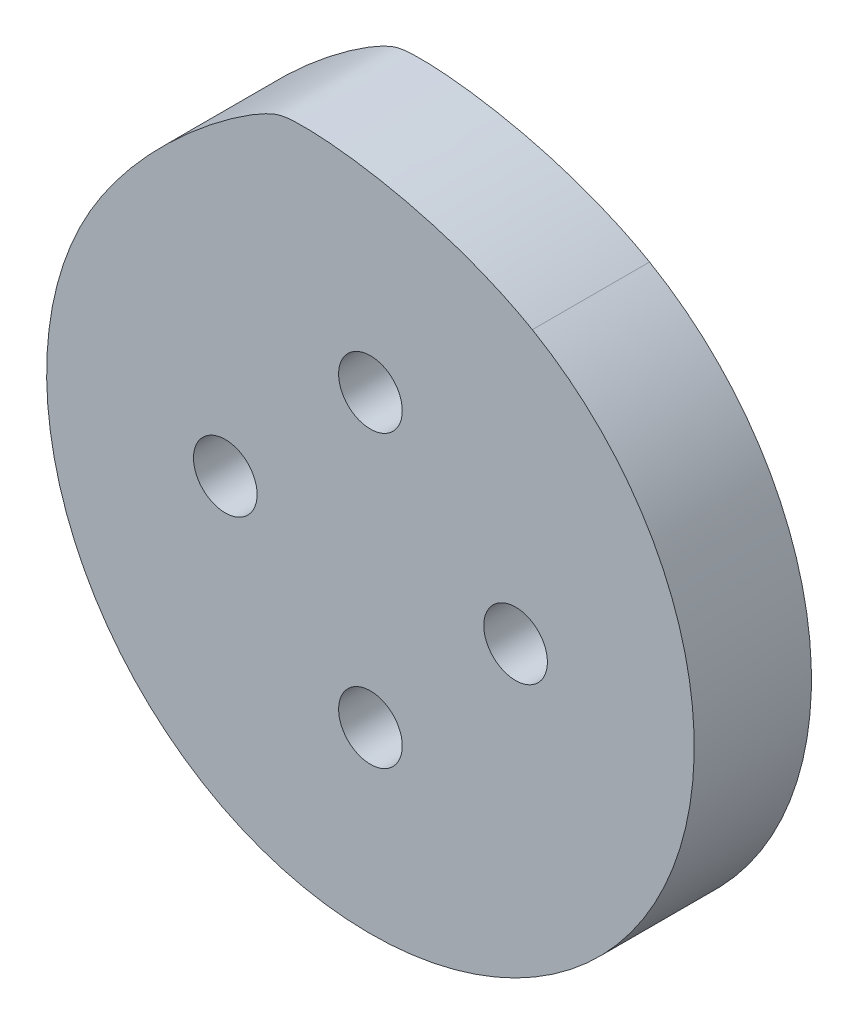
ISO-10303-21;
HEADER;
FILE_DESCRIPTION(('STEP AP214'),'2;1');
FILE_NAME('part.step','',(''),(''),'','','');
FILE_SCHEMA(('AUTOMOTIVE_DESIGN { 1 0 10303 214 1 1 1 1 }'));
ENDSEC;
DATA;
#1=APPLICATION_CONTEXT('core data for automotive mechanical design processes');
#2=APPLICATION_PROTOCOL_DEFINITION('international standard','automotive_design',2000,#1);
#3=PRODUCT_CONTEXT('',#1,'mechanical');
#4=PRODUCT('Part','Part','',(#3));
#5=PRODUCT_RELATED_PRODUCT_CATEGORY('part','',(#4));
#6=PRODUCT_DEFINITION_FORMATION('','',#4);
#7=PRODUCT_DEFINITION_CONTEXT('part definition',#1,'design');
#8=PRODUCT_DEFINITION('design','',#6,#7);
#9=PRODUCT_DEFINITION_SHAPE('','',#8);
#10=(LENGTH_UNIT() NAMED_UNIT(*) SI_UNIT(.MILLI.,.METRE.));
#11=(NAMED_UNIT(*) PLANE_ANGLE_UNIT() SI_UNIT($,.RADIAN.));
#12=(NAMED_UNIT(*) SI_UNIT($,.STERADIAN.) SOLID_ANGLE_UNIT());
#13=UNCERTAINTY_MEASURE_WITH_UNIT(LENGTH_MEASURE(1.E-05),#10,'distance_accuracy_value','');
#14=(GEOMETRIC_REPRESENTATION_CONTEXT(3) GLOBAL_UNCERTAINTY_ASSIGNED_CONTEXT((#13)) GLOBAL_UNIT_ASSIGNED_CONTEXT((#10,
#11,#12)) REPRESENTATION_CONTEXT('',''));
#15=CARTESIAN_POINT('',(0.,0.,0.));
#16=DIRECTION('',(0.,0.,1.));
#17=DIRECTION('',(1.,0.,0.));
#18=AXIS2_PLACEMENT_3D('',#15,#16,#17);
#19=CARTESIAN_POINT('',(13.,0.,10.5));
#20=DIRECTION('',(0.,0.,-1.));
#21=DIRECTION('',(-1.,0.,0.));
#22=AXIS2_PLACEMENT_3D('',#19,#20,#21);
#23=CYLINDRICAL_SURFACE('',#22,1.6);
#24=CARTESIAN_POINT('',(13.,0.,-0.5));
#25=DIRECTION('',(0.,0.,-1.));
#26=DIRECTION('',(-1.,0.,0.));
#27=AXIS2_PLACEMENT_3D('',#24,#25,#26);
#28=CIRCLE('',#27,1.6);
#29=CARTESIAN_POINT('',(11.4,0.,-0.5));
#30=VERTEX_POINT('',#29);
#31=EDGE_CURVE('E131',#30,#30,#28,.T.);
#32=ORIENTED_EDGE('',*,*,#31,.T.);
#33=EDGE_LOOP('',(#32));
#34=FACE_BOUND('',#33,.T.);
#35=CARTESIAN_POINT('',(13.,0.,2.));
#36=DIRECTION('',(0.,0.,1.));
#37=DIRECTION('',(1.,0.,0.));
#38=AXIS2_PLACEMENT_3D('',#35,#36,#37);
#39=CIRCLE('',#38,1.6);
#40=CARTESIAN_POINT('',(14.6,0.,2.));
#41=VERTEX_POINT('',#40);
#42=EDGE_CURVE('E193',#41,#41,#39,.T.);
#43=ORIENTED_EDGE('',*,*,#42,.T.);
#44=EDGE_LOOP('',(#43));
#45=FACE_BOUND('',#44,.T.);
#46=ADVANCED_FACE('F49',(#34,#45),#23,.F.);
#47=CARTESIAN_POINT('',(0.,13.,10.5));
#48=DIRECTION('',(0.,0.,-1.));
#49=DIRECTION('',(-1.,0.,0.));
#50=AXIS2_PLACEMENT_3D('',#47,#48,#49);
#51=CYLINDRICAL_SURFACE('',#50,1.6);
#52=CARTESIAN_POINT('',(0.,13.,-0.5));
#53=DIRECTION('',(0.,0.,-1.));
#54=DIRECTION('',(-1.,0.,0.));
#55=AXIS2_PLACEMENT_3D('',#52,#53,#54);
#56=CIRCLE('',#55,1.6);
#57=CARTESIAN_POINT('',(-1.59999999999996,13.,-0.5));
#58=VERTEX_POINT('',#57);
#59=EDGE_CURVE('E125',#58,#58,#56,.T.);
#60=ORIENTED_EDGE('',*,*,#59,.T.);
#61=EDGE_LOOP('',(#60));
#62=FACE_BOUND('',#61,.T.);
#63=CARTESIAN_POINT('',(0.,13.,2.));
#64=DIRECTION('',(0.,0.,1.));
#65=DIRECTION('',(1.,0.,0.));
#66=AXIS2_PLACEMENT_3D('',#63,#64,#65);
#67=CIRCLE('',#66,1.6);
#68=CARTESIAN_POINT('',(1.60000000000005,13.,2.));
#69=VERTEX_POINT('',#68);
#70=EDGE_CURVE('E191',#69,#69,#67,.T.);
#71=ORIENTED_EDGE('',*,*,#70,.T.);
#72=EDGE_LOOP('',(#71));
#73=FACE_BOUND('',#72,.T.);
#74=ADVANCED_FACE('F182',(#62,#73),#51,.F.);
#75=CARTESIAN_POINT('',(-13.,0.,10.5));
#76=DIRECTION('',(0.,0.,-1.));
#77=DIRECTION('',(-1.,0.,0.));
#78=AXIS2_PLACEMENT_3D('',#75,#76,#77);
#79=CYLINDRICAL_SURFACE('',#78,1.6);
#80=CARTESIAN_POINT('',(-13.,0.,-0.5));
#81=DIRECTION('',(0.,0.,-1.));
#82=DIRECTION('',(-1.,0.,0.));
#83=AXIS2_PLACEMENT_3D('',#80,#81,#82);
#84=CIRCLE('',#83,1.6);
#85=CARTESIAN_POINT('',(-14.6,0.,-0.5));
#86=VERTEX_POINT('',#85);
#87=EDGE_CURVE('E148',#86,#86,#84,.T.);
#88=ORIENTED_EDGE('',*,*,#87,.T.);
#89=EDGE_LOOP('',(#88));
#90=FACE_BOUND('',#89,.T.);
#91=CARTESIAN_POINT('',(-13.,0.,2.));
#92=DIRECTION('',(0.,0.,1.));
#93=DIRECTION('',(1.,0.,0.));
#94=AXIS2_PLACEMENT_3D('',#91,#92,#93);
#95=CIRCLE('',#94,1.6);
#96=CARTESIAN_POINT('',(-11.4,0.,2.));
#97=VERTEX_POINT('',#96);
#98=EDGE_CURVE('E202',#97,#97,#95,.T.);
#99=ORIENTED_EDGE('',*,*,#98,.T.);
#100=EDGE_LOOP('',(#99));
#101=FACE_BOUND('',#100,.T.);
#102=ADVANCED_FACE('F51',(#90,#101),#79,.F.);
#103=CARTESIAN_POINT('',(-1.36167772214882E-13,-13.,10.5));
#104=DIRECTION('',(0.,0.,-1.));
#105=DIRECTION('',(-1.,0.,0.));
#106=AXIS2_PLACEMENT_3D('',#103,#104,#105);
#107=CYLINDRICAL_SURFACE('',#106,1.6);
#108=CARTESIAN_POINT('',(-1.36167772214882E-13,-13.,-0.5));
#109=DIRECTION('',(0.,0.,-1.));
#110=DIRECTION('',(-1.,0.,0.));
#111=AXIS2_PLACEMENT_3D('',#108,#109,#110);
#112=CIRCLE('',#111,1.6);
#113=CARTESIAN_POINT('',(-1.60000000000014,-13.,-0.5));
#114=VERTEX_POINT('',#113);
#115=EDGE_CURVE('E139',#114,#114,#112,.T.);
#116=ORIENTED_EDGE('',*,*,#115,.T.);
#117=EDGE_LOOP('',(#116));
#118=FACE_BOUND('',#117,.T.);
#119=CARTESIAN_POINT('',(-1.36167772214882E-13,-13.,2.));
#120=DIRECTION('',(0.,0.,1.));
#121=DIRECTION('',(1.,0.,0.));
#122=AXIS2_PLACEMENT_3D('',#119,#120,#121);
#123=CIRCLE('',#122,1.6);
#124=CARTESIAN_POINT('',(1.59999999999987,-13.,2.));
#125=VERTEX_POINT('',#124);
#126=EDGE_CURVE('E142',#125,#125,#123,.T.);
#127=ORIENTED_EDGE('',*,*,#126,.T.);
#128=EDGE_LOOP('',(#127));
#129=FACE_BOUND('',#128,.T.);
#130=ADVANCED_FACE('F174',(#118,#129),#107,.F.);
#131=CARTESIAN_POINT('',(0.,0.,10.5));
#132=DIRECTION('',(0.,0.,1.));
#133=DIRECTION('',(1.,0.,0.));
#134=AXIS2_PLACEMENT_3D('',#131,#132,#133);
#135=PLANE('',#134);
#136=CARTESIAN_POINT('',(13.,0.,10.5));
#137=DIRECTION('',(0.,0.,1.));
#138=DIRECTION('',(1.,0.,0.));
#139=AXIS2_PLACEMENT_3D('',#136,#137,#138);
#140=CIRCLE('',#139,2.85);
#141=CARTESIAN_POINT('',(15.85,0.,10.5));
#142=VERTEX_POINT('',#141);
#143=EDGE_CURVE('E116',#142,#142,#140,.F.);
#144=ORIENTED_EDGE('',*,*,#143,.T.);
#145=EDGE_LOOP('',(#144));
#146=FACE_BOUND('',#145,.T.);
#147=CARTESIAN_POINT('',(0.,-13.0000000000001,10.5));
#148=DIRECTION('',(0.,0.,1.));
#149=DIRECTION('',(1.,0.,0.));
#150=AXIS2_PLACEMENT_3D('',#147,#148,#149);
#151=CIRCLE('',#150,2.85);
#152=CARTESIAN_POINT('',(2.84999999999995,-13.0000000000001,10.5));
#153=VERTEX_POINT('',#152);
#154=EDGE_CURVE('E108',#153,#153,#151,.F.);
#155=ORIENTED_EDGE('',*,*,#154,.T.);
#156=EDGE_LOOP('',(#155));
#157=FACE_BOUND('',#156,.T.);
#158=CARTESIAN_POINT('',(0.,0.,10.5));
#159=DIRECTION('',(0.,0.,1.));
#160=DIRECTION('',(1.,0.,0.));
#161=AXIS2_PLACEMENT_3D('',#158,#159,#160);
#162=CIRCLE('',#161,29.);
#163=CARTESIAN_POINT('',(14.4999999999999,25.1147367097488,10.5000000000001));
#164=VERTEX_POINT('',#163);
#165=CARTESIAN_POINT('',(-25.1147367097489,14.4999999999998,10.5));
#166=VERTEX_POINT('',#165);
#167=EDGE_CURVE('E66',#164,#166,#162,.F.);
#168=ORIENTED_EDGE('',*,*,#167,.F.);
#169=CARTESIAN_POINT('',(-25.1147367097489,14.4999999999998,10.5));
#170=CARTESIAN_POINT('',(-20.614736709749,22.2942286340598,10.5));
#171=CARTESIAN_POINT('',(-10.6926613267179,29.7860536237782,10.5));
#172=CARTESIAN_POINT('',(-5.6329104688884,31.1418097800364,10.5));
#173=CARTESIAN_POINT('',(6.7057713659399,29.6147367097487,10.5));
#174=CARTESIAN_POINT('',(14.4999999999999,25.1147367097488,10.5));
#175=B_SPLINE_CURVE_WITH_KNOTS('',3,(#169,#170,#171,#172,#173,#174),.UNSPECIFIED.,.F.,.F.,(4,1,
1,4),(0.,0.45,0.55,1.),.UNSPECIFIED.);
#176=EDGE_CURVE('E59',#166,#164,#175,.T.);
#177=ORIENTED_EDGE('',*,*,#176,.F.);
#178=EDGE_LOOP('',(#168,#177));
#179=FACE_BOUND('',#178,.T.);
#180=CARTESIAN_POINT('',(-13.,0.,10.5));
#181=DIRECTION('',(0.,0.,1.));
#182=DIRECTION('',(1.,0.,0.));
#183=AXIS2_PLACEMENT_3D('',#180,#181,#182);
#184=CIRCLE('',#183,2.85);
#185=CARTESIAN_POINT('',(-10.15,0.,10.5));
#186=VERTEX_POINT('',#185);
#187=EDGE_CURVE('E112',#186,#186,#184,.F.);
#188=ORIENTED_EDGE('',*,*,#187,.T.);
#189=EDGE_LOOP('',(#188));
#190=FACE_BOUND('',#189,.T.);
#191=CARTESIAN_POINT('',(0.,13.,10.5));
#192=DIRECTION('',(0.,0.,1.));
#193=DIRECTION('',(1.,0.,0.));
#194=AXIS2_PLACEMENT_3D('',#191,#192,#193);
#195=CIRCLE('',#194,2.85);
#196=CARTESIAN_POINT('',(2.85000000000005,13.,10.5));
#197=VERTEX_POINT('',#196);
#198=EDGE_CURVE('E53',#197,#197,#195,.F.);
#199=ORIENTED_EDGE('',*,*,#198,.T.);
#200=EDGE_LOOP('',(#199));
#201=FACE_BOUND('',#200,.T.);
#202=ADVANCED_FACE('F79',(#146,#157,#179,#190,#201),#135,.T.);
#203=CARTESIAN_POINT('',(0.,0.,0.));
#204=DIRECTION('',(0.,0.,1.));
#205=DIRECTION('',(1.,0.,0.));
#206=AXIS2_PLACEMENT_3D('',#203,#204,#205);
#207=PLANE('',#206);
#208=CARTESIAN_POINT('',(0.,0.,0.));
#209=DIRECTION('',(0.,0.,-1.));
#210=DIRECTION('',(-1.,0.,0.));
#211=AXIS2_PLACEMENT_3D('',#208,#209,#210);
#212=CIRCLE('',#211,29.);
#213=CARTESIAN_POINT('',(14.4999999999999,25.1147367097488,0.));
#214=VERTEX_POINT('',#213);
#215=CARTESIAN_POINT('',(-25.1147367097489,14.4999999999998,0.));
#216=VERTEX_POINT('',#215);
#217=EDGE_CURVE('E89',#214,#216,#212,.T.);
#218=ORIENTED_EDGE('',*,*,#217,.T.);
#219=CARTESIAN_POINT('',(-25.1147367097489,14.4999999999998,0.));
#220=CARTESIAN_POINT('',(-20.614736709749,22.2942286340598,0.));
#221=CARTESIAN_POINT('',(-10.6926613267179,29.7860536237782,0.));
#222=CARTESIAN_POINT('',(-5.6329104688884,31.1418097800364,0.));
#223=CARTESIAN_POINT('',(6.7057713659399,29.6147367097487,0.));
#224=CARTESIAN_POINT('',(14.4999999999999,25.1147367097488,0.));
#225=B_SPLINE_CURVE_WITH_KNOTS('',3,(#219,#220,#221,#222,#223,#224),.UNSPECIFIED.,.F.,.F.,(4,1,
1,4),(0.,0.45,0.55,1.),.UNSPECIFIED.);
#226=EDGE_CURVE('E94',#216,#214,#225,.T.);
#227=ORIENTED_EDGE('',*,*,#226,.T.);
#228=EDGE_LOOP('',(#218,#227));
#229=FACE_BOUND('',#228,.T.);
#230=CARTESIAN_POINT('',(0.,0.,0.));
#231=DIRECTION('',(0.,0.,1.));
#232=DIRECTION('',(1.,0.,0.));
#233=AXIS2_PLACEMENT_3D('',#230,#231,#232);
#234=CIRCLE('',#233,21.);
#235=CARTESIAN_POINT('',(21.,0.,0.));
#236=VERTEX_POINT('',#235);
#237=EDGE_CURVE('E11',#236,#236,#234,.F.);
#238=ORIENTED_EDGE('',*,*,#237,.F.);
#239=EDGE_LOOP('',(#238));
#240=FACE_BOUND('',#239,.T.);
#241=ADVANCED_FACE('F166',(#229,#240),#207,.F.);
#242=CARTESIAN_POINT('',(-25.1147367097489,14.4999999999998,94.0526018961593));
#243=CARTESIAN_POINT('',(-20.614736709749,22.2942286340598,94.0526018961593));
#244=CARTESIAN_POINT('',(-10.6926613267179,29.7860536237782,94.0526018961593));
#245=CARTESIAN_POINT('',(-5.6329104688884,31.1418097800364,94.0526018961593));
#246=CARTESIAN_POINT('',(6.7057713659399,29.6147367097487,94.0526018961593));
#247=CARTESIAN_POINT('',(14.4999999999999,25.1147367097488,94.0526018961593));
#248=B_SPLINE_CURVE_WITH_KNOTS('',3,(#242,#243,#244,#245,#246,#247),.UNSPECIFIED.,.F.,.F.,(4,1,
1,4),(0.,0.45,0.55,1.),.UNSPECIFIED.);
#249=DIRECTION('',(0.,0.,-1.));
#250=VECTOR('',#249,1.);
#251=SURFACE_OF_LINEAR_EXTRUSION('',#248,#250);
#252=DIRECTION('',(0.,0.,-1.));
#253=VECTOR('',#252,1.);
#254=CARTESIAN_POINT('',(-25.1147367097489,14.4999999999998,94.0526018961593));
#255=LINE('',#254,#253);
#256=EDGE_CURVE('E86',#166,#216,#255,.T.);
#257=ORIENTED_EDGE('',*,*,#256,.F.);
#258=ORIENTED_EDGE('',*,*,#176,.T.);
#259=DIRECTION('',(0.,0.,-1.));
#260=VECTOR('',#259,1.);
#261=CARTESIAN_POINT('',(14.4999999999999,25.1147367097488,94.0526018961593));
#262=LINE('',#261,#260);
#263=EDGE_CURVE('E73',#164,#214,#262,.T.);
#264=ORIENTED_EDGE('',*,*,#263,.T.);
#265=ORIENTED_EDGE('',*,*,#226,.F.);
#266=EDGE_LOOP('',(#257,#258,#264,#265));
#267=FACE_BOUND('',#266,.T.);
#268=ADVANCED_FACE('F92',(#267),#251,.T.);
#269=CARTESIAN_POINT('',(0.,0.,94.0526018961593));
#270=DIRECTION('',(0.,0.,-1.));
#271=DIRECTION('',(-1.,0.,0.));
#272=AXIS2_PLACEMENT_3D('',#269,#270,#271);
#273=CYLINDRICAL_SURFACE('',#272,29.);
#274=ORIENTED_EDGE('',*,*,#263,.F.);
#275=ORIENTED_EDGE('',*,*,#167,.T.);
#276=ORIENTED_EDGE('',*,*,#256,.T.);
#277=ORIENTED_EDGE('',*,*,#217,.F.);
#278=EDGE_LOOP('',(#274,#275,#276,#277));
#279=FACE_BOUND('',#278,.T.);
#280=ADVANCED_FACE('F85',(#279),#273,.T.);
#281=CARTESIAN_POINT('',(0.,0.,-0.5));
#282=DIRECTION('',(0.,0.,-1.));
#283=DIRECTION('',(-1.,0.,0.));
#284=AXIS2_PLACEMENT_3D('',#281,#282,#283);
#285=PLANE('',#284);
#286=ORIENTED_EDGE('',*,*,#31,.F.);
#287=EDGE_LOOP('',(#286));
#288=FACE_BOUND('',#287,.T.);
#289=ORIENTED_EDGE('',*,*,#87,.F.);
#290=EDGE_LOOP('',(#289));
#291=FACE_BOUND('',#290,.T.);
#292=CARTESIAN_POINT('',(0.,0.,-0.5));
#293=DIRECTION('',(0.,0.,-1.));
#294=DIRECTION('',(-1.,0.,0.));
#295=AXIS2_PLACEMENT_3D('',#292,#293,#294);
#296=CIRCLE('',#295,21.);
#297=CARTESIAN_POINT('',(-21.,0.,-0.5));
#298=VERTEX_POINT('',#297);
#299=EDGE_CURVE('E90',#298,#298,#296,.T.);
#300=ORIENTED_EDGE('',*,*,#299,.T.);
#301=EDGE_LOOP('',(#300));
#302=FACE_BOUND('',#301,.T.);
#303=ORIENTED_EDGE('',*,*,#115,.F.);
#304=EDGE_LOOP('',(#303));
#305=FACE_BOUND('',#304,.T.);
#306=ORIENTED_EDGE('',*,*,#59,.F.);
#307=EDGE_LOOP('',(#306));
#308=FACE_BOUND('',#307,.T.);
#309=ADVANCED_FACE('F171',(#288,#291,#302,#305,#308),#285,.T.);
#310=CARTESIAN_POINT('',(0.,0.,-0.5));
#311=DIRECTION('',(0.,0.,1.));
#312=DIRECTION('',(1.,0.,0.));
#313=AXIS2_PLACEMENT_3D('',#310,#311,#312);
#314=CYLINDRICAL_SURFACE('',#313,21.);
#315=ORIENTED_EDGE('',*,*,#299,.F.);
#316=EDGE_LOOP('',(#315));
#317=FACE_BOUND('',#316,.T.);
#318=ORIENTED_EDGE('',*,*,#237,.T.);
#319=EDGE_LOOP('',(#318));
#320=FACE_BOUND('',#319,.T.);
#321=ADVANCED_FACE('F167',(#317,#320),#314,.T.);
#322=CARTESIAN_POINT('',(0.,-13.0000000000001,10.500012));
#323=DIRECTION('',(0.,0.,-1.));
#324=DIRECTION('',(-1.,0.,0.));
#325=AXIS2_PLACEMENT_3D('',#322,#323,#324);
#326=CYLINDRICAL_SURFACE('',#325,2.85);
#327=ORIENTED_EDGE('',*,*,#154,.F.);
#328=EDGE_LOOP('',(#327));
#329=FACE_BOUND('',#328,.T.);
#330=CARTESIAN_POINT('',(0.,-13.0000000000001,2.));
#331=DIRECTION('',(0.,0.,1.));
#332=DIRECTION('',(1.,0.,0.));
#333=AXIS2_PLACEMENT_3D('',#330,#331,#332);
#334=CIRCLE('',#333,2.85);
#335=CARTESIAN_POINT('',(2.84999999999995,-13.0000000000001,2.));
#336=VERTEX_POINT('',#335);
#337=EDGE_CURVE('E209',#336,#336,#334,.T.);
#338=ORIENTED_EDGE('',*,*,#337,.F.);
#339=EDGE_LOOP('',(#338));
#340=FACE_BOUND('',#339,.T.);
#341=ADVANCED_FACE('F221',(#329,#340),#326,.F.);
#342=CARTESIAN_POINT('',(0.,-13.0000000000001,2.));
#343=DIRECTION('',(0.,0.,1.));
#344=DIRECTION('',(1.,0.,0.));
#345=AXIS2_PLACEMENT_3D('',#342,#343,#344);
#346=PLANE('',#345);
#347=ORIENTED_EDGE('',*,*,#126,.F.);
#348=EDGE_LOOP('',(#347));
#349=FACE_BOUND('',#348,.T.);
#350=ORIENTED_EDGE('',*,*,#337,.T.);
#351=EDGE_LOOP('',(#350));
#352=FACE_BOUND('',#351,.T.);
#353=ADVANCED_FACE('F218',(#349,#352),#346,.T.);
#354=CARTESIAN_POINT('',(-13.,0.,10.500012));
#355=DIRECTION('',(0.,0.,-1.));
#356=DIRECTION('',(-1.,0.,0.));
#357=AXIS2_PLACEMENT_3D('',#354,#355,#356);
#358=CYLINDRICAL_SURFACE('',#357,2.85);
#359=ORIENTED_EDGE('',*,*,#187,.F.);
#360=EDGE_LOOP('',(#359));
#361=FACE_BOUND('',#360,.T.);
#362=CARTESIAN_POINT('',(-13.,0.,2.));
#363=DIRECTION('',(0.,0.,1.));
#364=DIRECTION('',(1.,0.,0.));
#365=AXIS2_PLACEMENT_3D('',#362,#363,#364);
#366=CIRCLE('',#365,2.85);
#367=CARTESIAN_POINT('',(-10.15,0.,2.));
#368=VERTEX_POINT('',#367);
#369=EDGE_CURVE('E204',#368,#368,#366,.T.);
#370=ORIENTED_EDGE('',*,*,#369,.F.);
#371=EDGE_LOOP('',(#370));
#372=FACE_BOUND('',#371,.T.);
#373=ADVANCED_FACE('F220',(#361,#372),#358,.F.);
#374=CARTESIAN_POINT('',(-13.,0.,2.));
#375=DIRECTION('',(0.,0.,1.));
#376=DIRECTION('',(1.,0.,0.));
#377=AXIS2_PLACEMENT_3D('',#374,#375,#376);
#378=PLANE('',#377);
#379=ORIENTED_EDGE('',*,*,#98,.F.);
#380=EDGE_LOOP('',(#379));
#381=FACE_BOUND('',#380,.T.);
#382=ORIENTED_EDGE('',*,*,#369,.T.);
#383=EDGE_LOOP('',(#382));
#384=FACE_BOUND('',#383,.T.);
#385=ADVANCED_FACE('F226',(#381,#384),#378,.T.);
#386=CARTESIAN_POINT('',(13.,0.,10.500012));
#387=DIRECTION('',(0.,0.,-1.));
#388=DIRECTION('',(-1.,0.,0.));
#389=AXIS2_PLACEMENT_3D('',#386,#387,#388);
#390=CYLINDRICAL_SURFACE('',#389,2.85);
#391=ORIENTED_EDGE('',*,*,#143,.F.);
#392=EDGE_LOOP('',(#391));
#393=FACE_BOUND('',#392,.T.);
#394=CARTESIAN_POINT('',(13.,0.,2.));
#395=DIRECTION('',(0.,0.,1.));
#396=DIRECTION('',(1.,0.,0.));
#397=AXIS2_PLACEMENT_3D('',#394,#395,#396);
#398=CIRCLE('',#397,2.85);
#399=CARTESIAN_POINT('',(15.85,0.,2.));
#400=VERTEX_POINT('',#399);
#401=EDGE_CURVE('E198',#400,#400,#398,.T.);
#402=ORIENTED_EDGE('',*,*,#401,.F.);
#403=EDGE_LOOP('',(#402));
#404=FACE_BOUND('',#403,.T.);
#405=ADVANCED_FACE('F253',(#393,#404),#390,.F.);
#406=CARTESIAN_POINT('',(13.,0.,2.));
#407=DIRECTION('',(0.,0.,1.));
#408=DIRECTION('',(1.,0.,0.));
#409=AXIS2_PLACEMENT_3D('',#406,#407,#408);
#410=PLANE('',#409);
#411=ORIENTED_EDGE('',*,*,#42,.F.);
#412=EDGE_LOOP('',(#411));
#413=FACE_BOUND('',#412,.T.);
#414=ORIENTED_EDGE('',*,*,#401,.T.);
#415=EDGE_LOOP('',(#414));
#416=FACE_BOUND('',#415,.T.);
#417=ADVANCED_FACE('F258',(#413,#416),#410,.T.);
#418=CARTESIAN_POINT('',(0.,13.,10.500012));
#419=DIRECTION('',(0.,0.,-1.));
#420=DIRECTION('',(-1.,0.,0.));
#421=AXIS2_PLACEMENT_3D('',#418,#419,#420);
#422=CYLINDRICAL_SURFACE('',#421,2.85);
#423=ORIENTED_EDGE('',*,*,#198,.F.);
#424=EDGE_LOOP('',(#423));
#425=FACE_BOUND('',#424,.T.);
#426=CARTESIAN_POINT('',(0.,13.,2.));
#427=DIRECTION('',(0.,0.,1.));
#428=DIRECTION('',(1.,0.,0.));
#429=AXIS2_PLACEMENT_3D('',#426,#427,#428);
#430=CIRCLE('',#429,2.85);
#431=CARTESIAN_POINT('',(2.85000000000005,13.,2.));
#432=VERTEX_POINT('',#431);
#433=EDGE_CURVE('E113',#432,#432,#430,.T.);
#434=ORIENTED_EDGE('',*,*,#433,.F.);
#435=EDGE_LOOP('',(#434));
#436=FACE_BOUND('',#435,.T.);
#437=ADVANCED_FACE('F263',(#425,#436),#422,.F.);
#438=CARTESIAN_POINT('',(0.,13.,2.));
#439=DIRECTION('',(0.,0.,1.));
#440=DIRECTION('',(1.,0.,0.));
#441=AXIS2_PLACEMENT_3D('',#438,#439,#440);
#442=PLANE('',#441);
#443=ORIENTED_EDGE('',*,*,#70,.F.);
#444=EDGE_LOOP('',(#443));
#445=FACE_BOUND('',#444,.T.);
#446=ORIENTED_EDGE('',*,*,#433,.T.);
#447=EDGE_LOOP('',(#446));
#448=FACE_BOUND('',#447,.T.);
#449=ADVANCED_FACE('F268',(#445,#448),#442,.T.);
#450=CLOSED_SHELL('',(#46,#74,#102,#130,#202,#241,#268,#280,#309,#321,#341,#353,#373,#385,#405,
#417,#437,#449));
#451=MANIFOLD_SOLID_BREP('B2',#450);
#452=ADVANCED_BREP_SHAPE_REPRESENTATION('',(#18,#451),#14);
#453=SHAPE_DEFINITION_REPRESENTATION(#9,#452);
ENDSEC;
END-ISO-10303-21;
